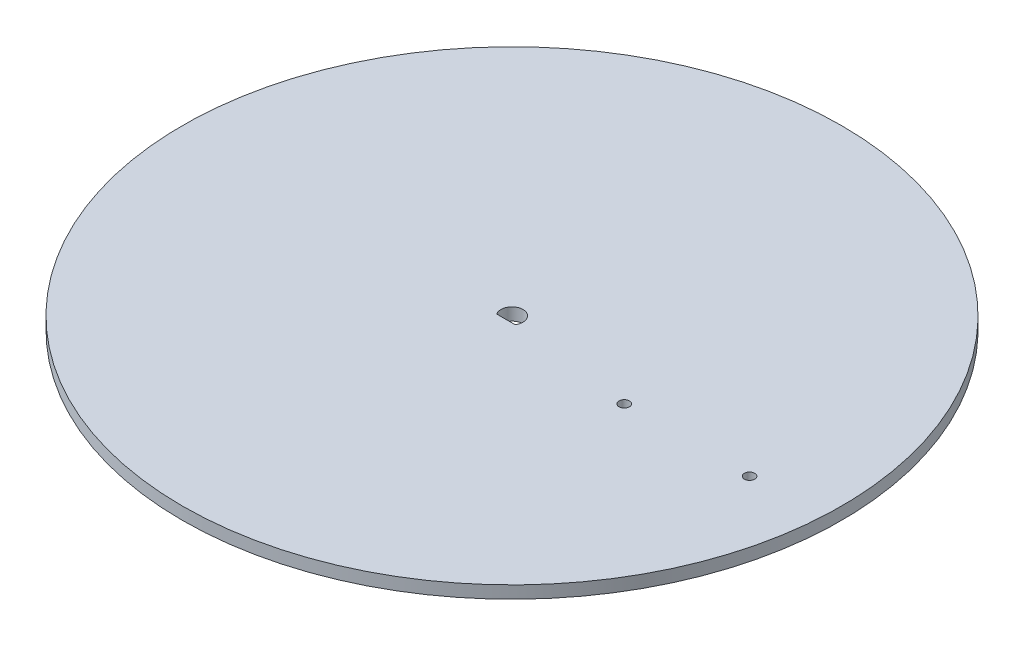
ISO-10303-21;
HEADER;
FILE_DESCRIPTION(('STEP AP214'),'2;1');
FILE_NAME('part.step','',(''),(''),'','','');
FILE_SCHEMA(('AUTOMOTIVE_DESIGN { 1 0 10303 214 1 1 1 1 }'));
ENDSEC;
DATA;
#1=APPLICATION_CONTEXT('core data for automotive mechanical design processes');
#2=APPLICATION_PROTOCOL_DEFINITION('international standard','automotive_design',2000,#1);
#3=PRODUCT_CONTEXT('',#1,'mechanical');
#4=PRODUCT('Part','Part','',(#3));
#5=PRODUCT_RELATED_PRODUCT_CATEGORY('part','',(#4));
#6=PRODUCT_DEFINITION_FORMATION('','',#4);
#7=PRODUCT_DEFINITION_CONTEXT('part definition',#1,'design');
#8=PRODUCT_DEFINITION('design','',#6,#7);
#9=PRODUCT_DEFINITION_SHAPE('','',#8);
#10=(LENGTH_UNIT() NAMED_UNIT(*) SI_UNIT(.MILLI.,.METRE.));
#11=(NAMED_UNIT(*) PLANE_ANGLE_UNIT() SI_UNIT($,.RADIAN.));
#12=(NAMED_UNIT(*) SI_UNIT($,.STERADIAN.) SOLID_ANGLE_UNIT());
#13=UNCERTAINTY_MEASURE_WITH_UNIT(LENGTH_MEASURE(1.E-05),#10,'distance_accuracy_value','');
#14=(GEOMETRIC_REPRESENTATION_CONTEXT(3) GLOBAL_UNCERTAINTY_ASSIGNED_CONTEXT((#13)) GLOBAL_UNIT_ASSIGNED_CONTEXT((#10,
#11,#12)) REPRESENTATION_CONTEXT('',''));
#15=CARTESIAN_POINT('',(0.,0.,0.));
#16=DIRECTION('',(0.,0.,1.));
#17=DIRECTION('',(1.,0.,0.));
#18=AXIS2_PLACEMENT_3D('',#15,#16,#17);
#19=CARTESIAN_POINT('',(0.,0.,0.));
#20=DIRECTION('',(0.,1.,0.));
#21=DIRECTION('',(0.,0.,1.));
#22=AXIS2_PLACEMENT_3D('',#19,#20,#21);
#23=PLANE('',#22);
#24=CARTESIAN_POINT('',(13.7432890350295,0.,70.8415877079415));
#25=DIRECTION('',(0.,1.,0.));
#26=DIRECTION('',(0.,0.,1.));
#27=AXIS2_PLACEMENT_3D('',#24,#25,#26);
#28=CIRCLE('',#27,67.31);
#29=CARTESIAN_POINT('',(13.7432890350295,0.,138.151587707942));
#30=VERTEX_POINT('',#29);
#31=EDGE_CURVE('E86',#30,#30,#28,.T.);
#32=ORIENTED_EDGE('',*,*,#31,.F.);
#33=EDGE_LOOP('',(#32));
#34=FACE_BOUND('',#33,.T.);
#35=CARTESIAN_POINT('',(40.7795689405013,0.,74.952013207777));
#36=DIRECTION('',(0.,1.,0.));
#37=DIRECTION('',(0.,0.,1.));
#38=AXIS2_PLACEMENT_3D('',#35,#36,#37);
#39=CIRCLE('',#38,1.05429477609715);
#40=CARTESIAN_POINT('',(40.7795689405013,0.,76.0063079838742));
#41=VERTEX_POINT('',#40);
#42=EDGE_CURVE('E78',#41,#41,#39,.T.);
#43=ORIENTED_EDGE('',*,*,#42,.T.);
#44=EDGE_LOOP('',(#43));
#45=FACE_BOUND('',#44,.T.);
#46=CARTESIAN_POINT('',(66.3720586462217,0.,74.952013207777));
#47=DIRECTION('',(0.,1.,0.));
#48=DIRECTION('',(0.,0.,1.));
#49=AXIS2_PLACEMENT_3D('',#46,#47,#48);
#50=CIRCLE('',#49,1.05429477609715);
#51=CARTESIAN_POINT('',(66.3720586462217,0.,76.0063079838742));
#52=VERTEX_POINT('',#51);
#53=EDGE_CURVE('E75',#52,#52,#50,.T.);
#54=ORIENTED_EDGE('',*,*,#53,.T.);
#55=EDGE_LOOP('',(#54));
#56=FACE_BOUND('',#55,.T.);
#57=CARTESIAN_POINT('',(13.7432890350295,0.,70.8415877079431));
#58=DIRECTION('',(0.,1.,0.));
#59=DIRECTION('',(0.,0.,1.));
#60=AXIS2_PLACEMENT_3D('',#57,#58,#59);
#61=CIRCLE('',#60,2.25);
#62=CARTESIAN_POINT('',(11.8724603416425,0.,72.0915877079431));
#63=VERTEX_POINT('',#62);
#64=CARTESIAN_POINT('',(15.6141177284164,0.,72.0915877079431));
#65=VERTEX_POINT('',#64);
#66=EDGE_CURVE('E11',#63,#65,#61,.F.);
#67=ORIENTED_EDGE('',*,*,#66,.F.);
#68=DIRECTION('',(-1.,0.,0.));
#69=VECTOR('',#68,1.);
#70=CARTESIAN_POINT('',(-2.51706433169856E-13,0.,72.0915877079431));
#71=LINE('',#70,#69);
#72=EDGE_CURVE('E45',#65,#63,#71,.T.);
#73=ORIENTED_EDGE('',*,*,#72,.F.);
#74=EDGE_LOOP('',(#67,#73));
#75=FACE_BOUND('',#74,.T.);
#76=ADVANCED_FACE('F37',(#34,#45,#56,#75),#23,.F.);
#77=CARTESIAN_POINT('',(40.7795689405013,2.54,74.952013207777));
#78=DIRECTION('',(0.,-1.,0.));
#79=DIRECTION('',(0.,0.,-1.));
#80=AXIS2_PLACEMENT_3D('',#77,#78,#79);
#81=CYLINDRICAL_SURFACE('',#80,1.05429477609715);
#82=CARTESIAN_POINT('',(40.7795689405013,2.54,74.952013207777));
#83=DIRECTION('',(0.,1.,0.));
#84=DIRECTION('',(0.,0.,1.));
#85=AXIS2_PLACEMENT_3D('',#82,#83,#84);
#86=CIRCLE('',#85,1.05429477609715);
#87=CARTESIAN_POINT('',(40.7795689405013,2.54,76.0063079838742));
#88=VERTEX_POINT('',#87);
#89=EDGE_CURVE('E85',#88,#88,#86,.T.);
#90=ORIENTED_EDGE('',*,*,#89,.T.);
#91=EDGE_LOOP('',(#90));
#92=FACE_BOUND('',#91,.T.);
#93=ORIENTED_EDGE('',*,*,#42,.F.);
#94=EDGE_LOOP('',(#93));
#95=FACE_BOUND('',#94,.T.);
#96=ADVANCED_FACE('F97',(#92,#95),#81,.F.);
#97=CARTESIAN_POINT('',(66.3720586462217,2.54,74.952013207777));
#98=DIRECTION('',(0.,-1.,0.));
#99=DIRECTION('',(0.,0.,-1.));
#100=AXIS2_PLACEMENT_3D('',#97,#98,#99);
#101=CYLINDRICAL_SURFACE('',#100,1.05429477609715);
#102=CARTESIAN_POINT('',(66.3720586462217,2.54,74.952013207777));
#103=DIRECTION('',(0.,1.,0.));
#104=DIRECTION('',(0.,0.,1.));
#105=AXIS2_PLACEMENT_3D('',#102,#103,#104);
#106=CIRCLE('',#105,1.05429477609715);
#107=CARTESIAN_POINT('',(66.3720586462217,2.54,76.0063079838742));
#108=VERTEX_POINT('',#107);
#109=EDGE_CURVE('E82',#108,#108,#106,.T.);
#110=ORIENTED_EDGE('',*,*,#109,.T.);
#111=EDGE_LOOP('',(#110));
#112=FACE_BOUND('',#111,.T.);
#113=ORIENTED_EDGE('',*,*,#53,.F.);
#114=EDGE_LOOP('',(#113));
#115=FACE_BOUND('',#114,.T.);
#116=ADVANCED_FACE('F39',(#112,#115),#101,.F.);
#117=CARTESIAN_POINT('',(13.7432890350295,2.54,70.8415877079415));
#118=DIRECTION('',(0.,-1.,0.));
#119=DIRECTION('',(0.,0.,-1.));
#120=AXIS2_PLACEMENT_3D('',#117,#118,#119);
#121=CYLINDRICAL_SURFACE('',#120,67.31);
#122=CARTESIAN_POINT('',(13.7432890350295,2.54,70.8415877079415));
#123=DIRECTION('',(0.,1.,0.));
#124=DIRECTION('',(0.,0.,1.));
#125=AXIS2_PLACEMENT_3D('',#122,#123,#124);
#126=CIRCLE('',#125,67.31);
#127=CARTESIAN_POINT('',(13.7432890350295,2.54,138.151587707942));
#128=VERTEX_POINT('',#127);
#129=EDGE_CURVE('E89',#128,#128,#126,.T.);
#130=ORIENTED_EDGE('',*,*,#129,.F.);
#131=EDGE_LOOP('',(#130));
#132=FACE_BOUND('',#131,.T.);
#133=ORIENTED_EDGE('',*,*,#31,.T.);
#134=EDGE_LOOP('',(#133));
#135=FACE_BOUND('',#134,.T.);
#136=ADVANCED_FACE('F109',(#132,#135),#121,.T.);
#137=CARTESIAN_POINT('',(0.,2.54,0.));
#138=DIRECTION('',(0.,1.,0.));
#139=DIRECTION('',(0.,0.,1.));
#140=AXIS2_PLACEMENT_3D('',#137,#138,#139);
#141=PLANE('',#140);
#142=DIRECTION('',(1.,0.,0.));
#143=VECTOR('',#142,1.);
#144=CARTESIAN_POINT('',(-8.67268502567385,2.53999999999788,72.0915877079431));
#145=LINE('',#144,#143);
#146=CARTESIAN_POINT('',(11.8724603416425,2.54,72.0915877079431));
#147=VERTEX_POINT('',#146);
#148=CARTESIAN_POINT('',(15.6141177284164,2.53999999999788,72.0915877079432));
#149=VERTEX_POINT('',#148);
#150=EDGE_CURVE('E69',#147,#149,#145,.T.);
#151=ORIENTED_EDGE('',*,*,#150,.F.);
#152=CARTESIAN_POINT('',(13.7432890350295,2.54,70.8415877079432));
#153=DIRECTION('',(0.,1.,0.));
#154=DIRECTION('',(0.,0.,1.));
#155=AXIS2_PLACEMENT_3D('',#152,#153,#154);
#156=CIRCLE('',#155,2.25);
#157=EDGE_CURVE('E64',#147,#149,#156,.F.);
#158=ORIENTED_EDGE('',*,*,#157,.T.);
#159=EDGE_LOOP('',(#151,#158));
#160=FACE_BOUND('',#159,.T.);
#161=ORIENTED_EDGE('',*,*,#109,.F.);
#162=EDGE_LOOP('',(#161));
#163=FACE_BOUND('',#162,.T.);
#164=ORIENTED_EDGE('',*,*,#89,.F.);
#165=EDGE_LOOP('',(#164));
#166=FACE_BOUND('',#165,.T.);
#167=ORIENTED_EDGE('',*,*,#129,.T.);
#168=EDGE_LOOP('',(#167));
#169=FACE_BOUND('',#168,.T.);
#170=ADVANCED_FACE('F73',(#160,#163,#166,#169),#141,.T.);
#171=CARTESIAN_POINT('',(13.7432890350295,-9.46000000000211,70.8415877079431));
#172=DIRECTION('',(0.,1.,0.));
#173=DIRECTION('',(-1.,0.,0.));
#174=AXIS2_PLACEMENT_3D('',#171,#172,#173);
#175=CYLINDRICAL_SURFACE('',#174,2.25);
#176=DIRECTION('',(0.,-1.,0.));
#177=VECTOR('',#176,1.);
#178=CARTESIAN_POINT('',(11.8724603416425,2.53999999999788,72.0915877079431));
#179=LINE('',#178,#177);
#180=EDGE_CURVE('E52',#147,#63,#179,.T.);
#181=ORIENTED_EDGE('',*,*,#180,.T.);
#182=ORIENTED_EDGE('',*,*,#66,.T.);
#183=DIRECTION('',(0.,-1.,0.));
#184=VECTOR('',#183,1.);
#185=CARTESIAN_POINT('',(15.6141177284164,2.53999999999788,72.0915877079432));
#186=LINE('',#185,#184);
#187=EDGE_CURVE('E57',#149,#65,#186,.T.);
#188=ORIENTED_EDGE('',*,*,#187,.F.);
#189=ORIENTED_EDGE('',*,*,#157,.F.);
#190=EDGE_LOOP('',(#181,#182,#188,#189));
#191=FACE_BOUND('',#190,.T.);
#192=ADVANCED_FACE('F62',(#191),#175,.F.);
#193=CARTESIAN_POINT('',(-8.67268502567385,2.53999999999788,72.0915877079431));
#194=DIRECTION('',(0.,0.,-1.));
#195=DIRECTION('',(1.,0.,0.));
#196=AXIS2_PLACEMENT_3D('',#193,#194,#195);
#197=PLANE('',#196);
#198=ORIENTED_EDGE('',*,*,#72,.T.);
#199=ORIENTED_EDGE('',*,*,#180,.F.);
#200=ORIENTED_EDGE('',*,*,#150,.T.);
#201=ORIENTED_EDGE('',*,*,#187,.T.);
#202=EDGE_LOOP('',(#198,#199,#200,#201));
#203=FACE_BOUND('',#202,.T.);
#204=ADVANCED_FACE('F70',(#203),#197,.T.);
#205=CLOSED_SHELL('',(#76,#96,#116,#136,#170,#192,#204));
#206=MANIFOLD_SOLID_BREP('B2',#205);
#207=ADVANCED_BREP_SHAPE_REPRESENTATION('',(#18,#206),#14);
#208=SHAPE_DEFINITION_REPRESENTATION(#9,#207);
ENDSEC;
END-ISO-10303-21;
